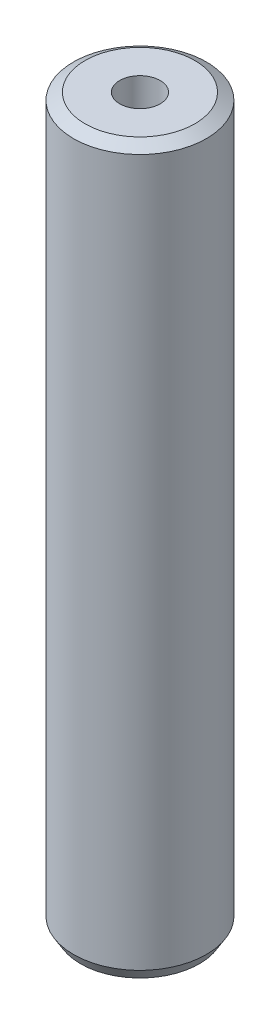
ISO-10303-21;
HEADER;
FILE_DESCRIPTION(('STEP AP214'),'2;1');
FILE_NAME('part.step','',(''),(''),'','','');
FILE_SCHEMA(('AUTOMOTIVE_DESIGN { 1 0 10303 214 1 1 1 1 }'));
ENDSEC;
DATA;
#1=APPLICATION_CONTEXT('core data for automotive mechanical design processes');
#2=APPLICATION_PROTOCOL_DEFINITION('international standard','automotive_design',2000,#1);
#3=PRODUCT_CONTEXT('',#1,'mechanical');
#4=PRODUCT('Part','Part','',(#3));
#5=PRODUCT_RELATED_PRODUCT_CATEGORY('part','',(#4));
#6=PRODUCT_DEFINITION_FORMATION('','',#4);
#7=PRODUCT_DEFINITION_CONTEXT('part definition',#1,'design');
#8=PRODUCT_DEFINITION('design','',#6,#7);
#9=PRODUCT_DEFINITION_SHAPE('','',#8);
#10=(LENGTH_UNIT() NAMED_UNIT(*) SI_UNIT(.MILLI.,.METRE.));
#11=(NAMED_UNIT(*) PLANE_ANGLE_UNIT() SI_UNIT($,.RADIAN.));
#12=(NAMED_UNIT(*) SI_UNIT($,.STERADIAN.) SOLID_ANGLE_UNIT());
#13=UNCERTAINTY_MEASURE_WITH_UNIT(LENGTH_MEASURE(1.E-05),#10,'distance_accuracy_value','');
#14=(GEOMETRIC_REPRESENTATION_CONTEXT(3) GLOBAL_UNCERTAINTY_ASSIGNED_CONTEXT((#13)) GLOBAL_UNIT_ASSIGNED_CONTEXT((#10,
#11,#12)) REPRESENTATION_CONTEXT('',''));
#15=CARTESIAN_POINT('',(0.,0.,0.));
#16=DIRECTION('',(0.,0.,1.));
#17=DIRECTION('',(1.,0.,0.));
#18=AXIS2_PLACEMENT_3D('',#15,#16,#17);
#19=CARTESIAN_POINT('',(0.,600.,0.));
#20=DIRECTION('',(0.,-1.,0.));
#21=DIRECTION('',(0.,0.,-1.));
#22=AXIS2_PLACEMENT_3D('',#19,#20,#21);
#23=CYLINDRICAL_SURFACE('',#22,55.);
#24=CARTESIAN_POINT('',(0.,594.190989962202,0.));
#25=DIRECTION('',(0.,1.,0.));
#26=DIRECTION('',(0.,0.,1.));
#27=AXIS2_PLACEMENT_3D('',#24,#25,#26);
#28=CIRCLE('',#27,55.);
#29=CARTESIAN_POINT('',(0.,594.190989962202,55.));
#30=VERTEX_POINT('',#29);
#31=EDGE_CURVE('E50',#30,#30,#28,.F.);
#32=ORIENTED_EDGE('',*,*,#31,.T.);
#33=EDGE_LOOP('',(#32));
#34=FACE_BOUND('',#33,.T.);
#35=CARTESIAN_POINT('',(0.,9.59487710541329,0.));
#36=DIRECTION('',(0.,1.,0.));
#37=DIRECTION('',(0.,0.,1.));
#38=AXIS2_PLACEMENT_3D('',#35,#36,#37);
#39=CIRCLE('',#38,55.);
#40=CARTESIAN_POINT('',(0.,9.59487710541329,55.));
#41=VERTEX_POINT('',#40);
#42=EDGE_CURVE('E51',#41,#41,#39,.T.);
#43=ORIENTED_EDGE('',*,*,#42,.T.);
#44=EDGE_LOOP('',(#43));
#45=FACE_BOUND('',#44,.T.);
#46=ADVANCED_FACE('F39',(#34,#45),#23,.T.);
#47=CARTESIAN_POINT('',(0.,600.,0.));
#48=DIRECTION('',(0.,1.,0.));
#49=DIRECTION('',(0.,0.,1.));
#50=AXIS2_PLACEMENT_3D('',#47,#48,#49);
#51=PLANE('',#50);
#52=CARTESIAN_POINT('',(0.,600.,0.));
#53=DIRECTION('',(0.,1.,0.));
#54=DIRECTION('',(0.,0.,1.));
#55=AXIS2_PLACEMENT_3D('',#52,#53,#54);
#56=CIRCLE('',#55,45.4051228945866);
#57=CARTESIAN_POINT('',(0.,600.,45.4051228945866));
#58=VERTEX_POINT('',#57);
#59=EDGE_CURVE('E54',#58,#58,#56,.T.);
#60=ORIENTED_EDGE('',*,*,#59,.T.);
#61=EDGE_LOOP('',(#60));
#62=FACE_BOUND('',#61,.T.);
#63=CARTESIAN_POINT('',(0.,600.,0.));
#64=DIRECTION('',(0.,1.,0.));
#65=DIRECTION('',(0.,0.,1.));
#66=AXIS2_PLACEMENT_3D('',#63,#64,#65);
#67=CIRCLE('',#66,16.7473795278499);
#68=CARTESIAN_POINT('',(0.,600.,16.7473795278499));
#69=VERTEX_POINT('',#68);
#70=EDGE_CURVE('E58',#69,#69,#67,.T.);
#71=ORIENTED_EDGE('',*,*,#70,.F.);
#72=EDGE_LOOP('',(#71));
#73=FACE_BOUND('',#72,.T.);
#74=ADVANCED_FACE('F69',(#62,#73),#51,.T.);
#75=CARTESIAN_POINT('',(0.,0.,0.));
#76=DIRECTION('',(0.,1.,0.));
#77=DIRECTION('',(0.,0.,1.));
#78=AXIS2_PLACEMENT_3D('',#75,#76,#77);
#79=PLANE('',#78);
#80=CARTESIAN_POINT('',(0.,0.,0.));
#81=DIRECTION('',(0.,1.,0.));
#82=DIRECTION('',(0.,0.,1.));
#83=AXIS2_PLACEMENT_3D('',#80,#81,#82);
#84=CIRCLE('',#83,49.1909899622022);
#85=CARTESIAN_POINT('',(0.,0.,49.1909899622022));
#86=VERTEX_POINT('',#85);
#87=EDGE_CURVE('E10',#86,#86,#84,.F.);
#88=ORIENTED_EDGE('',*,*,#87,.T.);
#89=EDGE_LOOP('',(#88));
#90=FACE_BOUND('',#89,.T.);
#91=CARTESIAN_POINT('',(0.,0.,0.));
#92=DIRECTION('',(0.,1.,0.));
#93=DIRECTION('',(0.,0.,1.));
#94=AXIS2_PLACEMENT_3D('',#91,#92,#93);
#95=CIRCLE('',#94,16.7473795278499);
#96=CARTESIAN_POINT('',(0.,0.,16.7473795278499));
#97=VERTEX_POINT('',#96);
#98=EDGE_CURVE('E63',#97,#97,#95,.T.);
#99=ORIENTED_EDGE('',*,*,#98,.T.);
#100=EDGE_LOOP('',(#99));
#101=FACE_BOUND('',#100,.T.);
#102=ADVANCED_FACE('F75',(#90,#101),#79,.F.);
#103=CARTESIAN_POINT('',(0.,600.,0.));
#104=DIRECTION('',(0.,-1.,0.));
#105=DIRECTION('',(0.,0.,-1.));
#106=AXIS2_PLACEMENT_3D('',#103,#104,#105);
#107=CYLINDRICAL_SURFACE('',#106,16.7473795278499);
#108=ORIENTED_EDGE('',*,*,#70,.T.);
#109=EDGE_LOOP('',(#108));
#110=FACE_BOUND('',#109,.T.);
#111=ORIENTED_EDGE('',*,*,#98,.F.);
#112=EDGE_LOOP('',(#111));
#113=FACE_BOUND('',#112,.T.);
#114=ADVANCED_FACE('F70',(#110,#113),#107,.F.);
#115=CARTESIAN_POINT('',(0.,600.,0.));
#116=DIRECTION('',(0.,-1.,0.));
#117=DIRECTION('',(0.,0.,-1.));
#118=AXIS2_PLACEMENT_3D('',#115,#116,#117);
#119=CONICAL_SURFACE('',#118,45.4051228945866,1.02639499380886);
#120=ORIENTED_EDGE('',*,*,#31,.F.);
#121=EDGE_LOOP('',(#120));
#122=FACE_BOUND('',#121,.T.);
#123=ORIENTED_EDGE('',*,*,#59,.F.);
#124=EDGE_LOOP('',(#123));
#125=FACE_BOUND('',#124,.T.);
#126=ADVANCED_FACE('F81',(#122,#125),#119,.T.);
#127=CARTESIAN_POINT('',(0.,9.59487710541329,0.));
#128=DIRECTION('',(0.,1.,0.));
#129=DIRECTION('',(0.,0.,1.));
#130=AXIS2_PLACEMENT_3D('',#127,#128,#129);
#131=CONICAL_SURFACE('',#130,55.,0.544401332986043);
#132=ORIENTED_EDGE('',*,*,#87,.F.);
#133=EDGE_LOOP('',(#132));
#134=FACE_BOUND('',#133,.T.);
#135=ORIENTED_EDGE('',*,*,#42,.F.);
#136=EDGE_LOOP('',(#135));
#137=FACE_BOUND('',#136,.T.);
#138=ADVANCED_FACE('F45',(#134,#137),#131,.T.);
#139=CLOSED_SHELL('',(#46,#74,#102,#114,#126,#138));
#140=MANIFOLD_SOLID_BREP('B2',#139);
#141=ADVANCED_BREP_SHAPE_REPRESENTATION('',(#18,#140),#14);
#142=SHAPE_DEFINITION_REPRESENTATION(#9,#141);
ENDSEC;
END-ISO-10303-21;
